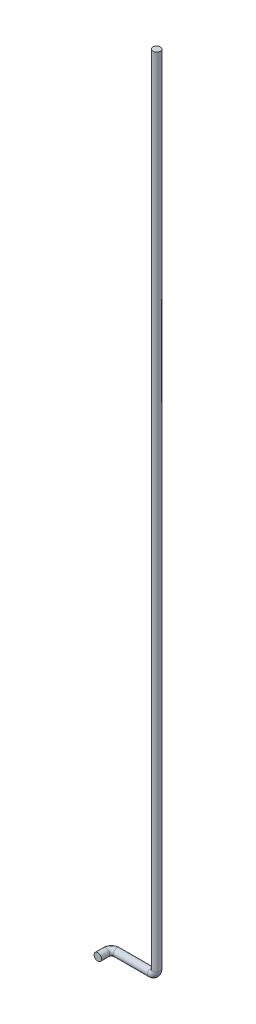
ISO-10303-21;
HEADER;
FILE_DESCRIPTION(('STEP AP214'),'2;1');
FILE_NAME('part.step','',(''),(''),'','','');
FILE_SCHEMA(('AUTOMOTIVE_DESIGN { 1 0 10303 214 1 1 1 1 }'));
ENDSEC;
DATA;
#1=APPLICATION_CONTEXT('core data for automotive mechanical design processes');
#2=APPLICATION_PROTOCOL_DEFINITION('international standard','automotive_design',2000,#1);
#3=PRODUCT_CONTEXT('',#1,'mechanical');
#4=PRODUCT('Part','Part','',(#3));
#5=PRODUCT_RELATED_PRODUCT_CATEGORY('part','',(#4));
#6=PRODUCT_DEFINITION_FORMATION('','',#4);
#7=PRODUCT_DEFINITION_CONTEXT('part definition',#1,'design');
#8=PRODUCT_DEFINITION('design','',#6,#7);
#9=PRODUCT_DEFINITION_SHAPE('','',#8);
#10=(LENGTH_UNIT() NAMED_UNIT(*) SI_UNIT(.MILLI.,.METRE.));
#11=(NAMED_UNIT(*) PLANE_ANGLE_UNIT() SI_UNIT($,.RADIAN.));
#12=(NAMED_UNIT(*) SI_UNIT($,.STERADIAN.) SOLID_ANGLE_UNIT());
#13=UNCERTAINTY_MEASURE_WITH_UNIT(LENGTH_MEASURE(1.E-05),#10,'distance_accuracy_value','');
#14=(GEOMETRIC_REPRESENTATION_CONTEXT(3) GLOBAL_UNCERTAINTY_ASSIGNED_CONTEXT((#13)) GLOBAL_UNIT_ASSIGNED_CONTEXT((#10,
#11,#12)) REPRESENTATION_CONTEXT('',''));
#15=CARTESIAN_POINT('',(0.,0.,0.));
#16=DIRECTION('',(0.,0.,1.));
#17=DIRECTION('',(1.,0.,0.));
#18=AXIS2_PLACEMENT_3D('',#15,#16,#17);
#19=CARTESIAN_POINT('',(0.,0.,0.));
#20=DIRECTION('',(0.,1.,0.));
#21=DIRECTION('',(0.,0.,1.));
#22=AXIS2_PLACEMENT_3D('',#19,#20,#21);
#23=PLANE('',#22);
#24=CARTESIAN_POINT('',(0.,0.,0.));
#25=DIRECTION('',(0.,1.,0.));
#26=DIRECTION('',(0.,0.,1.));
#27=AXIS2_PLACEMENT_3D('',#24,#25,#26);
#28=CIRCLE('',#27,13.7);
#29=CARTESIAN_POINT('',(0.,0.,13.7));
#30=VERTEX_POINT('',#29);
#31=EDGE_CURVE('E46',#30,#30,#28,.T.);
#32=ORIENTED_EDGE('',*,*,#31,.T.);
#33=EDGE_LOOP('',(#32));
#34=FACE_BOUND('',#33,.T.);
#35=ADVANCED_FACE('F34',(#34),#23,.T.);
#36=CARTESIAN_POINT('',(-166.,-2945.,50.));
#37=DIRECTION('',(0.,0.,-1.));
#38=DIRECTION('',(1.,0.,0.));
#39=AXIS2_PLACEMENT_3D('',#36,#37,#38);
#40=PLANE('',#39);
#41=CARTESIAN_POINT('',(-166.,-2945.,50.));
#42=DIRECTION('',(0.,0.,-1.));
#43=DIRECTION('',(1.,0.,0.));
#44=AXIS2_PLACEMENT_3D('',#41,#42,#43);
#45=CIRCLE('',#44,13.7);
#46=CARTESIAN_POINT('',(-152.3,-2945.,50.));
#47=VERTEX_POINT('',#46);
#48=EDGE_CURVE('E11',#47,#47,#45,.T.);
#49=ORIENTED_EDGE('',*,*,#48,.F.);
#50=EDGE_LOOP('',(#49));
#51=FACE_BOUND('',#50,.T.);
#52=ADVANCED_FACE('F52',(#51),#40,.F.);
#53=CARTESIAN_POINT('',(0.,0.,0.));
#54=DIRECTION('',(0.,-1.,0.));
#55=DIRECTION('',(0.,0.,-1.));
#56=AXIS2_PLACEMENT_3D('',#53,#54,#55);
#57=CYLINDRICAL_SURFACE('',#56,13.7);
#58=CARTESIAN_POINT('',(0.,-2925.,0.));
#59=DIRECTION('',(0.,1.,0.));
#60=DIRECTION('',(0.,0.,1.));
#61=AXIS2_PLACEMENT_3D('',#58,#59,#60);
#62=CIRCLE('',#61,13.7);
#63=CARTESIAN_POINT('',(13.7,-2925.,0.));
#64=VERTEX_POINT('',#63);
#65=EDGE_CURVE('E86',#64,#64,#62,.T.);
#66=ORIENTED_EDGE('',*,*,#65,.T.);
#67=EDGE_LOOP('',(#66));
#68=FACE_BOUND('',#67,.T.);
#69=ORIENTED_EDGE('',*,*,#31,.F.);
#70=EDGE_LOOP('',(#69));
#71=FACE_BOUND('',#70,.T.);
#72=ADVANCED_FACE('F54',(#68,#71),#57,.T.);
#73=CARTESIAN_POINT('',(-20.,-2925.,0.));
#74=DIRECTION('',(0.,0.,-1.));
#75=DIRECTION('',(-1.,0.,0.));
#76=AXIS2_PLACEMENT_3D('',#73,#74,#75);
#77=TOROIDAL_SURFACE('',#76,20.,13.7);
#78=CARTESIAN_POINT('',(-20.,-2945.,0.));
#79=DIRECTION('',(1.,0.,0.));
#80=DIRECTION('',(0.,0.,1.));
#81=AXIS2_PLACEMENT_3D('',#78,#79,#80);
#82=CIRCLE('',#81,13.7);
#83=CARTESIAN_POINT('',(-20.,-2958.7,0.));
#84=VERTEX_POINT('',#83);
#85=EDGE_CURVE('E83',#84,#84,#82,.T.);
#86=CARTESIAN_POINT('',(-20.,-2925.,0.));
#87=DIRECTION('',(0.,0.,-1.));
#88=DIRECTION('',(-1.,0.,0.));
#89=AXIS2_PLACEMENT_3D('',#86,#87,#88);
#90=CIRCLE('',#89,33.7);
#91=EDGE_CURVE('',#64,#84,#90,.T.);
#92=ORIENTED_EDGE('',*,*,#65,.F.);
#93=ORIENTED_EDGE('',*,*,#85,.T.);
#94=ORIENTED_EDGE('',*,*,#91,.T.);
#95=ORIENTED_EDGE('',*,*,#91,.F.);
#96=EDGE_LOOP('',(#92,#94,#93,#95));
#97=FACE_BOUND('',#96,.T.);
#98=ADVANCED_FACE('F59',(#97),#77,.T.);
#99=CARTESIAN_POINT('',(-20.,-2945.,0.));
#100=DIRECTION('',(-1.,0.,0.));
#101=DIRECTION('',(0.,0.,1.));
#102=AXIS2_PLACEMENT_3D('',#99,#100,#101);
#103=CYLINDRICAL_SURFACE('',#102,13.7);
#104=CARTESIAN_POINT('',(-146.,-2945.,0.));
#105=DIRECTION('',(1.,0.,0.));
#106=DIRECTION('',(0.,0.,1.));
#107=AXIS2_PLACEMENT_3D('',#104,#105,#106);
#108=CIRCLE('',#107,13.7);
#109=CARTESIAN_POINT('',(-146.,-2945.,-13.7));
#110=VERTEX_POINT('',#109);
#111=EDGE_CURVE('E88',#110,#110,#108,.T.);
#112=ORIENTED_EDGE('',*,*,#111,.T.);
#113=EDGE_LOOP('',(#112));
#114=FACE_BOUND('',#113,.T.);
#115=ORIENTED_EDGE('',*,*,#85,.F.);
#116=EDGE_LOOP('',(#115));
#117=FACE_BOUND('',#116,.T.);
#118=ADVANCED_FACE('F69',(#114,#117),#103,.T.);
#119=CARTESIAN_POINT('',(-146.,-2945.,20.));
#120=DIRECTION('',(0.,1.,0.));
#121=DIRECTION('',(0.,0.,1.));
#122=AXIS2_PLACEMENT_3D('',#119,#120,#121);
#123=TOROIDAL_SURFACE('',#122,20.,13.7);
#124=CARTESIAN_POINT('',(-166.,-2945.,20.));
#125=DIRECTION('',(0.,0.,-1.));
#126=DIRECTION('',(1.,0.,0.));
#127=AXIS2_PLACEMENT_3D('',#124,#125,#126);
#128=CIRCLE('',#127,13.7);
#129=CARTESIAN_POINT('',(-179.7,-2945.,20.));
#130=VERTEX_POINT('',#129);
#131=EDGE_CURVE('E41',#130,#130,#128,.T.);
#132=CARTESIAN_POINT('',(-146.,-2945.,20.));
#133=DIRECTION('',(0.,1.,0.));
#134=DIRECTION('',(0.,0.,1.));
#135=AXIS2_PLACEMENT_3D('',#132,#133,#134);
#136=CIRCLE('',#135,33.7);
#137=EDGE_CURVE('',#110,#130,#136,.T.);
#138=ORIENTED_EDGE('',*,*,#111,.F.);
#139=ORIENTED_EDGE('',*,*,#131,.T.);
#140=ORIENTED_EDGE('',*,*,#137,.T.);
#141=ORIENTED_EDGE('',*,*,#137,.F.);
#142=EDGE_LOOP('',(#138,#140,#139,#141));
#143=FACE_BOUND('',#142,.T.);
#144=ADVANCED_FACE('F65',(#143),#123,.T.);
#145=CARTESIAN_POINT('',(-166.,-2945.,20.));
#146=DIRECTION('',(0.,0.,1.));
#147=DIRECTION('',(1.,0.,0.));
#148=AXIS2_PLACEMENT_3D('',#145,#146,#147);
#149=CYLINDRICAL_SURFACE('',#148,13.7);
#150=ORIENTED_EDGE('',*,*,#48,.T.);
#151=EDGE_LOOP('',(#150));
#152=FACE_BOUND('',#151,.T.);
#153=ORIENTED_EDGE('',*,*,#131,.F.);
#154=EDGE_LOOP('',(#153));
#155=FACE_BOUND('',#154,.T.);
#156=ADVANCED_FACE('F49',(#152,#155),#149,.T.);
#157=CLOSED_SHELL('',(#35,#52,#72,#98,#118,#144,#156));
#158=MANIFOLD_SOLID_BREP('B2',#157);
#159=ADVANCED_BREP_SHAPE_REPRESENTATION('',(#18,#158),#14);
#160=SHAPE_DEFINITION_REPRESENTATION(#9,#159);
ENDSEC;
END-ISO-10303-21;
